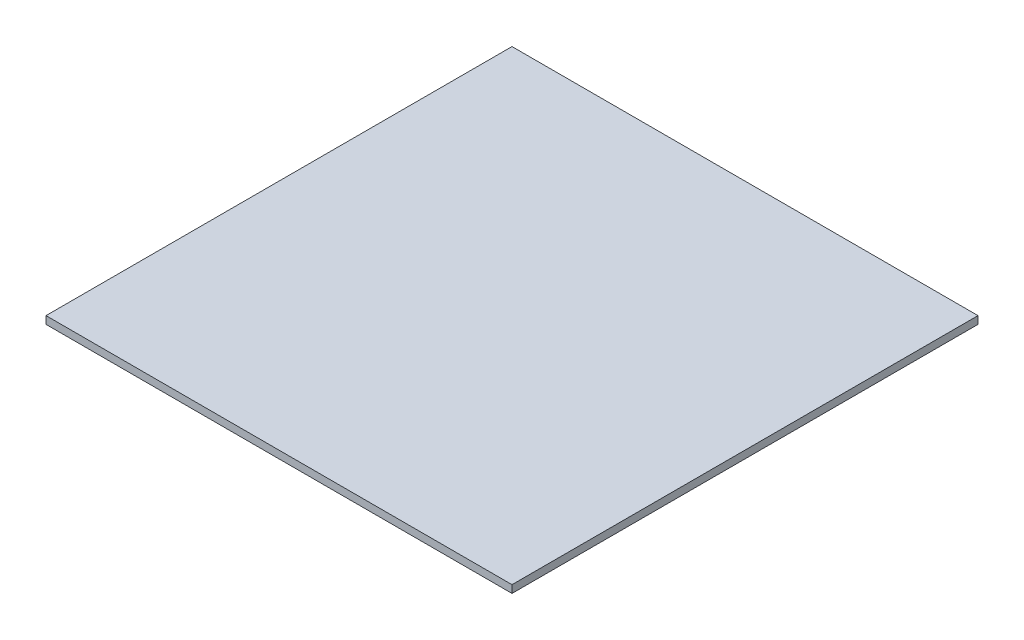
ISO-10303-21;
HEADER;
FILE_DESCRIPTION(('STEP AP214'),'2;1');
FILE_NAME('part.step','',(''),(''),'','','');
FILE_SCHEMA(('AUTOMOTIVE_DESIGN { 1 0 10303 214 1 1 1 1 }'));
ENDSEC;
DATA;
#1=APPLICATION_CONTEXT('core data for automotive mechanical design processes');
#2=APPLICATION_PROTOCOL_DEFINITION('international standard','automotive_design',2000,#1);
#3=PRODUCT_CONTEXT('',#1,'mechanical');
#4=PRODUCT('Part','Part','',(#3));
#5=PRODUCT_RELATED_PRODUCT_CATEGORY('part','',(#4));
#6=PRODUCT_DEFINITION_FORMATION('','',#4);
#7=PRODUCT_DEFINITION_CONTEXT('part definition',#1,'design');
#8=PRODUCT_DEFINITION('design','',#6,#7);
#9=PRODUCT_DEFINITION_SHAPE('','',#8);
#10=(LENGTH_UNIT() NAMED_UNIT(*) SI_UNIT(.MILLI.,.METRE.));
#11=(NAMED_UNIT(*) PLANE_ANGLE_UNIT() SI_UNIT($,.RADIAN.));
#12=(NAMED_UNIT(*) SI_UNIT($,.STERADIAN.) SOLID_ANGLE_UNIT());
#13=UNCERTAINTY_MEASURE_WITH_UNIT(LENGTH_MEASURE(1.E-05),#10,'distance_accuracy_value','');
#14=(GEOMETRIC_REPRESENTATION_CONTEXT(3) GLOBAL_UNCERTAINTY_ASSIGNED_CONTEXT((#13)) GLOBAL_UNIT_ASSIGNED_CONTEXT((#10,
#11,#12)) REPRESENTATION_CONTEXT('',''));
#15=CARTESIAN_POINT('',(0.,0.,0.));
#16=DIRECTION('',(0.,0.,1.));
#17=DIRECTION('',(1.,0.,0.));
#18=AXIS2_PLACEMENT_3D('',#15,#16,#17);
#19=CARTESIAN_POINT('',(0.,6.223,0.));
#20=DIRECTION('',(1.,0.,0.));
#21=DIRECTION('',(0.,0.,-1.));
#22=AXIS2_PLACEMENT_3D('',#19,#20,#21);
#23=PLANE('',#22);
#24=DIRECTION('',(0.,0.,1.));
#25=VECTOR('',#24,1.);
#26=CARTESIAN_POINT('',(0.,0.,0.));
#27=LINE('',#26,#25);
#28=CARTESIAN_POINT('',(0.,0.,-381.));
#29=VERTEX_POINT('',#28);
#30=CARTESIAN_POINT('',(0.,0.,0.));
#31=VERTEX_POINT('',#30);
#32=EDGE_CURVE('E96',#29,#31,#27,.T.);
#33=ORIENTED_EDGE('',*,*,#32,.T.);
#34=DIRECTION('',(0.,-1.,0.));
#35=VECTOR('',#34,1.);
#36=CARTESIAN_POINT('',(0.,6.223,0.));
#37=LINE('',#36,#35);
#38=CARTESIAN_POINT('',(0.,6.223,0.));
#39=VERTEX_POINT('',#38);
#40=EDGE_CURVE('E11',#39,#31,#37,.T.);
#41=ORIENTED_EDGE('',*,*,#40,.F.);
#42=DIRECTION('',(0.,0.,1.));
#43=VECTOR('',#42,1.);
#44=CARTESIAN_POINT('',(0.,6.223,0.));
#45=LINE('',#44,#43);
#46=CARTESIAN_POINT('',(0.,6.223,-381.));
#47=VERTEX_POINT('',#46);
#48=EDGE_CURVE('E84',#47,#39,#45,.T.);
#49=ORIENTED_EDGE('',*,*,#48,.F.);
#50=DIRECTION('',(0.,-1.,0.));
#51=VECTOR('',#50,1.);
#52=CARTESIAN_POINT('',(0.,6.223,-381.));
#53=LINE('',#52,#51);
#54=EDGE_CURVE('E92',#47,#29,#53,.T.);
#55=ORIENTED_EDGE('',*,*,#54,.T.);
#56=EDGE_LOOP('',(#33,#41,#49,#55));
#57=FACE_BOUND('',#56,.T.);
#58=ADVANCED_FACE('F33',(#57),#23,.F.);
#59=CARTESIAN_POINT('',(0.,6.223,0.));
#60=DIRECTION('',(0.,0.,-1.));
#61=DIRECTION('',(-1.,0.,0.));
#62=AXIS2_PLACEMENT_3D('',#59,#60,#61);
#63=PLANE('',#62);
#64=DIRECTION('',(1.,0.,0.));
#65=VECTOR('',#64,1.);
#66=CARTESIAN_POINT('',(0.,0.,0.));
#67=LINE('',#66,#65);
#68=CARTESIAN_POINT('',(381.,0.,0.));
#69=VERTEX_POINT('',#68);
#70=EDGE_CURVE('E88',#31,#69,#67,.T.);
#71=ORIENTED_EDGE('',*,*,#70,.T.);
#72=DIRECTION('',(0.,-1.,0.));
#73=VECTOR('',#72,1.);
#74=CARTESIAN_POINT('',(381.,6.223,0.));
#75=LINE('',#74,#73);
#76=CARTESIAN_POINT('',(381.,6.223,0.));
#77=VERTEX_POINT('',#76);
#78=EDGE_CURVE('E41',#77,#69,#75,.T.);
#79=ORIENTED_EDGE('',*,*,#78,.F.);
#80=DIRECTION('',(1.,0.,0.));
#81=VECTOR('',#80,1.);
#82=CARTESIAN_POINT('',(0.,6.223,0.));
#83=LINE('',#82,#81);
#84=EDGE_CURVE('E79',#39,#77,#83,.T.);
#85=ORIENTED_EDGE('',*,*,#84,.F.);
#86=ORIENTED_EDGE('',*,*,#40,.T.);
#87=EDGE_LOOP('',(#71,#79,#85,#86));
#88=FACE_BOUND('',#87,.T.);
#89=ADVANCED_FACE('F87',(#88),#63,.F.);
#90=CARTESIAN_POINT('',(381.,6.223,0.));
#91=DIRECTION('',(-1.,0.,0.));
#92=DIRECTION('',(0.,0.,1.));
#93=AXIS2_PLACEMENT_3D('',#90,#91,#92);
#94=PLANE('',#93);
#95=DIRECTION('',(0.,0.,-1.));
#96=VECTOR('',#95,1.);
#97=CARTESIAN_POINT('',(381.,0.,0.));
#98=LINE('',#97,#96);
#99=CARTESIAN_POINT('',(381.,0.,-381.));
#100=VERTEX_POINT('',#99);
#101=EDGE_CURVE('E66',#69,#100,#98,.T.);
#102=ORIENTED_EDGE('',*,*,#101,.T.);
#103=DIRECTION('',(0.,-1.,0.));
#104=VECTOR('',#103,1.);
#105=CARTESIAN_POINT('',(381.,6.223,-381.));
#106=LINE('',#105,#104);
#107=CARTESIAN_POINT('',(381.,6.223,-381.));
#108=VERTEX_POINT('',#107);
#109=EDGE_CURVE('E89',#108,#100,#106,.T.);
#110=ORIENTED_EDGE('',*,*,#109,.F.);
#111=DIRECTION('',(0.,0.,-1.));
#112=VECTOR('',#111,1.);
#113=CARTESIAN_POINT('',(381.,6.223,0.));
#114=LINE('',#113,#112);
#115=EDGE_CURVE('E82',#77,#108,#114,.T.);
#116=ORIENTED_EDGE('',*,*,#115,.F.);
#117=ORIENTED_EDGE('',*,*,#78,.T.);
#118=EDGE_LOOP('',(#102,#110,#116,#117));
#119=FACE_BOUND('',#118,.T.);
#120=ADVANCED_FACE('F90',(#119),#94,.F.);
#121=CARTESIAN_POINT('',(0.,6.223,-381.));
#122=DIRECTION('',(0.,0.,1.));
#123=DIRECTION('',(1.,0.,0.));
#124=AXIS2_PLACEMENT_3D('',#121,#122,#123);
#125=PLANE('',#124);
#126=DIRECTION('',(-1.,0.,0.));
#127=VECTOR('',#126,1.);
#128=CARTESIAN_POINT('',(0.,0.,-381.));
#129=LINE('',#128,#127);
#130=EDGE_CURVE('E72',#100,#29,#129,.T.);
#131=ORIENTED_EDGE('',*,*,#130,.T.);
#132=ORIENTED_EDGE('',*,*,#54,.F.);
#133=DIRECTION('',(-1.,0.,0.));
#134=VECTOR('',#133,1.);
#135=CARTESIAN_POINT('',(0.,6.223,-381.));
#136=LINE('',#135,#134);
#137=EDGE_CURVE('E49',#108,#47,#136,.T.);
#138=ORIENTED_EDGE('',*,*,#137,.F.);
#139=ORIENTED_EDGE('',*,*,#109,.T.);
#140=EDGE_LOOP('',(#131,#132,#138,#139));
#141=FACE_BOUND('',#140,.T.);
#142=ADVANCED_FACE('F103',(#141),#125,.F.);
#143=CARTESIAN_POINT('',(0.,6.223,0.));
#144=DIRECTION('',(0.,-1.,0.));
#145=DIRECTION('',(0.,0.,-1.));
#146=AXIS2_PLACEMENT_3D('',#143,#144,#145);
#147=PLANE('',#146);
#148=ORIENTED_EDGE('',*,*,#48,.T.);
#149=ORIENTED_EDGE('',*,*,#84,.T.);
#150=ORIENTED_EDGE('',*,*,#115,.T.);
#151=ORIENTED_EDGE('',*,*,#137,.T.);
#152=EDGE_LOOP('',(#148,#149,#150,#151));
#153=FACE_BOUND('',#152,.T.);
#154=ADVANCED_FACE('F80',(#153),#147,.F.);
#155=CARTESIAN_POINT('',(0.,0.,0.));
#156=DIRECTION('',(0.,-1.,0.));
#157=DIRECTION('',(0.,0.,-1.));
#158=AXIS2_PLACEMENT_3D('',#155,#156,#157);
#159=PLANE('',#158);
#160=ORIENTED_EDGE('',*,*,#32,.F.);
#161=ORIENTED_EDGE('',*,*,#130,.F.);
#162=ORIENTED_EDGE('',*,*,#101,.F.);
#163=ORIENTED_EDGE('',*,*,#70,.F.);
#164=EDGE_LOOP('',(#160,#161,#162,#163));
#165=FACE_BOUND('',#164,.T.);
#166=ADVANCED_FACE('F106',(#165),#159,.T.);
#167=CLOSED_SHELL('',(#58,#89,#120,#142,#154,#166));
#168=MANIFOLD_SOLID_BREP('B2',#167);
#169=ADVANCED_BREP_SHAPE_REPRESENTATION('',(#18,#168),#14);
#170=SHAPE_DEFINITION_REPRESENTATION(#9,#169);
ENDSEC;
END-ISO-10303-21;
